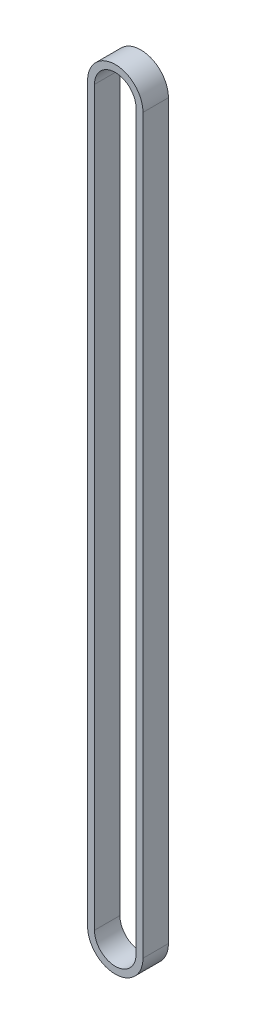
ISO-10303-21;
HEADER;
FILE_DESCRIPTION(('STEP AP214'),'2;1');
FILE_NAME('part.step','',(''),(''),'','','');
FILE_SCHEMA(('AUTOMOTIVE_DESIGN { 1 0 10303 214 1 1 1 1 }'));
ENDSEC;
DATA;
#1=APPLICATION_CONTEXT('core data for automotive mechanical design processes');
#2=APPLICATION_PROTOCOL_DEFINITION('international standard','automotive_design',2000,#1);
#3=PRODUCT_CONTEXT('',#1,'mechanical');
#4=PRODUCT('Part','Part','',(#3));
#5=PRODUCT_RELATED_PRODUCT_CATEGORY('part','',(#4));
#6=PRODUCT_DEFINITION_FORMATION('','',#4);
#7=PRODUCT_DEFINITION_CONTEXT('part definition',#1,'design');
#8=PRODUCT_DEFINITION('design','',#6,#7);
#9=PRODUCT_DEFINITION_SHAPE('','',#8);
#10=(LENGTH_UNIT() NAMED_UNIT(*) SI_UNIT(.MILLI.,.METRE.));
#11=(NAMED_UNIT(*) PLANE_ANGLE_UNIT() SI_UNIT($,.RADIAN.));
#12=(NAMED_UNIT(*) SI_UNIT($,.STERADIAN.) SOLID_ANGLE_UNIT());
#13=UNCERTAINTY_MEASURE_WITH_UNIT(LENGTH_MEASURE(1.E-05),#10,'distance_accuracy_value','');
#14=(GEOMETRIC_REPRESENTATION_CONTEXT(3) GLOBAL_UNCERTAINTY_ASSIGNED_CONTEXT((#13)) GLOBAL_UNIT_ASSIGNED_CONTEXT((#10,
#11,#12)) REPRESENTATION_CONTEXT('',''));
#15=CARTESIAN_POINT('',(0.,0.,0.));
#16=DIRECTION('',(0.,0.,1.));
#17=DIRECTION('',(1.,0.,0.));
#18=AXIS2_PLACEMENT_3D('',#15,#16,#17);
#19=CARTESIAN_POINT('',(0.,213.,7.4));
#20=DIRECTION('',(0.,0.,1.));
#21=DIRECTION('',(1.,0.,0.));
#22=AXIS2_PLACEMENT_3D('',#19,#20,#21);
#23=PLANE('',#22);
#24=CARTESIAN_POINT('',(0.,213.,7.4));
#25=DIRECTION('',(0.,0.,1.));
#26=DIRECTION('',(1.,0.,0.));
#27=AXIS2_PLACEMENT_3D('',#24,#25,#26);
#28=CIRCLE('',#27,8.05000000000004);
#29=CARTESIAN_POINT('',(8.05000000000004,213.,7.4));
#30=VERTEX_POINT('',#29);
#31=CARTESIAN_POINT('',(-8.05000000000004,213.,7.4));
#32=VERTEX_POINT('',#31);
#33=EDGE_CURVE('E138',#30,#32,#28,.T.);
#34=ORIENTED_EDGE('',*,*,#33,.T.);
#35=DIRECTION('',(0.,-1.,0.));
#36=VECTOR('',#35,1.);
#37=CARTESIAN_POINT('',(-8.05000000000004,213.,7.4));
#38=LINE('',#37,#36);
#39=CARTESIAN_POINT('',(-8.05000000000002,0.,7.4));
#40=VERTEX_POINT('',#39);
#41=EDGE_CURVE('E141',#32,#40,#38,.T.);
#42=ORIENTED_EDGE('',*,*,#41,.T.);
#43=CARTESIAN_POINT('',(0.,0.,7.4));
#44=DIRECTION('',(0.,0.,1.));
#45=DIRECTION('',(1.,0.,0.));
#46=AXIS2_PLACEMENT_3D('',#43,#44,#45);
#47=CIRCLE('',#46,8.05000000000002);
#48=CARTESIAN_POINT('',(8.05000000000002,0.,7.4));
#49=VERTEX_POINT('',#48);
#50=EDGE_CURVE('E144',#40,#49,#47,.T.);
#51=ORIENTED_EDGE('',*,*,#50,.T.);
#52=DIRECTION('',(0.,1.,0.));
#53=VECTOR('',#52,1.);
#54=CARTESIAN_POINT('',(8.05000000000004,213.,7.4));
#55=LINE('',#54,#53);
#56=EDGE_CURVE('E146',#49,#30,#55,.T.);
#57=ORIENTED_EDGE('',*,*,#56,.T.);
#58=EDGE_LOOP('',(#34,#42,#51,#57));
#59=FACE_BOUND('',#58,.T.);
#60=DIRECTION('',(0.,1.,0.));
#61=VECTOR('',#60,1.);
#62=CARTESIAN_POINT('',(6.05000000000015,0.,7.4));
#63=LINE('',#62,#61);
#64=CARTESIAN_POINT('',(6.05000000000015,0.,7.4));
#65=VERTEX_POINT('',#64);
#66=CARTESIAN_POINT('',(6.05,213.,7.4));
#67=VERTEX_POINT('',#66);
#68=EDGE_CURVE('E110',#65,#67,#63,.T.);
#69=ORIENTED_EDGE('',*,*,#68,.F.);
#70=CARTESIAN_POINT('',(0.,0.,7.4));
#71=DIRECTION('',(0.,0.,1.));
#72=DIRECTION('',(1.,0.,0.));
#73=AXIS2_PLACEMENT_3D('',#70,#71,#72);
#74=CIRCLE('',#73,6.05000000000008);
#75=CARTESIAN_POINT('',(-6.05,0.,7.4));
#76=VERTEX_POINT('',#75);
#77=EDGE_CURVE('E102',#76,#65,#74,.T.);
#78=ORIENTED_EDGE('',*,*,#77,.F.);
#79=DIRECTION('',(0.,-1.,0.));
#80=VECTOR('',#79,1.);
#81=CARTESIAN_POINT('',(-6.05,0.,7.4));
#82=LINE('',#81,#80);
#83=CARTESIAN_POINT('',(-6.05000000000004,213.,7.4));
#84=VERTEX_POINT('',#83);
#85=EDGE_CURVE('E124',#84,#76,#82,.T.);
#86=ORIENTED_EDGE('',*,*,#85,.F.);
#87=CARTESIAN_POINT('',(0.,213.,7.4));
#88=DIRECTION('',(0.,0.,1.));
#89=DIRECTION('',(1.,0.,0.));
#90=AXIS2_PLACEMENT_3D('',#87,#88,#89);
#91=CIRCLE('',#90,6.05);
#92=EDGE_CURVE('E122',#67,#84,#91,.T.);
#93=ORIENTED_EDGE('',*,*,#92,.F.);
#94=EDGE_LOOP('',(#69,#78,#86,#93));
#95=FACE_BOUND('',#94,.T.);
#96=ADVANCED_FACE('F37',(#59,#95),#23,.T.);
#97=CARTESIAN_POINT('',(0.,213.,0.));
#98=DIRECTION('',(0.,0.,1.));
#99=DIRECTION('',(1.,0.,0.));
#100=AXIS2_PLACEMENT_3D('',#97,#98,#99);
#101=PLANE('',#100);
#102=CARTESIAN_POINT('',(0.,213.,0.));
#103=DIRECTION('',(0.,0.,1.));
#104=DIRECTION('',(1.,0.,0.));
#105=AXIS2_PLACEMENT_3D('',#102,#103,#104);
#106=CIRCLE('',#105,8.05000000000004);
#107=CARTESIAN_POINT('',(8.05000000000004,213.,0.));
#108=VERTEX_POINT('',#107);
#109=CARTESIAN_POINT('',(-8.05000000000004,213.,0.));
#110=VERTEX_POINT('',#109);
#111=EDGE_CURVE('E118',#108,#110,#106,.T.);
#112=ORIENTED_EDGE('',*,*,#111,.F.);
#113=DIRECTION('',(0.,1.,0.));
#114=VECTOR('',#113,1.);
#115=CARTESIAN_POINT('',(8.05000000000004,213.,0.));
#116=LINE('',#115,#114);
#117=CARTESIAN_POINT('',(8.05000000000002,0.,0.));
#118=VERTEX_POINT('',#117);
#119=EDGE_CURVE('E142',#118,#108,#116,.T.);
#120=ORIENTED_EDGE('',*,*,#119,.F.);
#121=CARTESIAN_POINT('',(0.,0.,0.));
#122=DIRECTION('',(0.,0.,1.));
#123=DIRECTION('',(1.,0.,0.));
#124=AXIS2_PLACEMENT_3D('',#121,#122,#123);
#125=CIRCLE('',#124,8.05000000000002);
#126=CARTESIAN_POINT('',(-8.05000000000002,0.,0.));
#127=VERTEX_POINT('',#126);
#128=EDGE_CURVE('E153',#127,#118,#125,.T.);
#129=ORIENTED_EDGE('',*,*,#128,.F.);
#130=DIRECTION('',(0.,-1.,0.));
#131=VECTOR('',#130,1.);
#132=CARTESIAN_POINT('',(-8.05000000000004,213.,0.));
#133=LINE('',#132,#131);
#134=EDGE_CURVE('E151',#110,#127,#133,.T.);
#135=ORIENTED_EDGE('',*,*,#134,.F.);
#136=EDGE_LOOP('',(#112,#120,#129,#135));
#137=FACE_BOUND('',#136,.T.);
#138=CARTESIAN_POINT('',(0.,0.,0.));
#139=DIRECTION('',(0.,0.,1.));
#140=DIRECTION('',(1.,0.,0.));
#141=AXIS2_PLACEMENT_3D('',#138,#139,#140);
#142=CIRCLE('',#141,6.05000000000008);
#143=CARTESIAN_POINT('',(-6.05,0.,0.));
#144=VERTEX_POINT('',#143);
#145=CARTESIAN_POINT('',(6.05000000000015,0.,0.));
#146=VERTEX_POINT('',#145);
#147=EDGE_CURVE('E60',#144,#146,#142,.T.);
#148=ORIENTED_EDGE('',*,*,#147,.T.);
#149=DIRECTION('',(0.,1.,0.));
#150=VECTOR('',#149,1.);
#151=CARTESIAN_POINT('',(6.05000000000015,0.,0.));
#152=LINE('',#151,#150);
#153=CARTESIAN_POINT('',(6.05,213.,0.));
#154=VERTEX_POINT('',#153);
#155=EDGE_CURVE('E117',#146,#154,#152,.T.);
#156=ORIENTED_EDGE('',*,*,#155,.T.);
#157=CARTESIAN_POINT('',(0.,213.,0.));
#158=DIRECTION('',(0.,0.,1.));
#159=DIRECTION('',(1.,0.,0.));
#160=AXIS2_PLACEMENT_3D('',#157,#158,#159);
#161=CIRCLE('',#160,6.05);
#162=CARTESIAN_POINT('',(-6.05000000000004,213.,0.));
#163=VERTEX_POINT('',#162);
#164=EDGE_CURVE('E130',#154,#163,#161,.T.);
#165=ORIENTED_EDGE('',*,*,#164,.T.);
#166=DIRECTION('',(0.,-1.,0.));
#167=VECTOR('',#166,1.);
#168=CARTESIAN_POINT('',(-6.05,0.,0.));
#169=LINE('',#168,#167);
#170=EDGE_CURVE('E111',#163,#144,#169,.T.);
#171=ORIENTED_EDGE('',*,*,#170,.T.);
#172=EDGE_LOOP('',(#148,#156,#165,#171));
#173=FACE_BOUND('',#172,.T.);
#174=ADVANCED_FACE('F171',(#137,#173),#101,.F.);
#175=CARTESIAN_POINT('',(0.,213.,7.4));
#176=DIRECTION('',(0.,0.,-1.));
#177=DIRECTION('',(-1.,0.,0.));
#178=AXIS2_PLACEMENT_3D('',#175,#176,#177);
#179=CYLINDRICAL_SURFACE('',#178,8.05000000000004);
#180=ORIENTED_EDGE('',*,*,#111,.T.);
#181=DIRECTION('',(0.,0.,-1.));
#182=VECTOR('',#181,1.);
#183=CARTESIAN_POINT('',(-8.05000000000004,213.,7.4));
#184=LINE('',#183,#182);
#185=EDGE_CURVE('E11',#32,#110,#184,.T.);
#186=ORIENTED_EDGE('',*,*,#185,.F.);
#187=ORIENTED_EDGE('',*,*,#33,.F.);
#188=DIRECTION('',(0.,0.,-1.));
#189=VECTOR('',#188,1.);
#190=CARTESIAN_POINT('',(8.05000000000004,213.,7.4));
#191=LINE('',#190,#189);
#192=EDGE_CURVE('E148',#30,#108,#191,.T.);
#193=ORIENTED_EDGE('',*,*,#192,.T.);
#194=EDGE_LOOP('',(#180,#186,#187,#193));
#195=FACE_BOUND('',#194,.T.);
#196=ADVANCED_FACE('F39',(#195),#179,.T.);
#197=CARTESIAN_POINT('',(-8.05000000000004,213.,7.4));
#198=DIRECTION('',(1.,0.,0.));
#199=DIRECTION('',(0.,1.,0.));
#200=AXIS2_PLACEMENT_3D('',#197,#198,#199);
#201=PLANE('',#200);
#202=ORIENTED_EDGE('',*,*,#134,.T.);
#203=DIRECTION('',(0.,0.,-1.));
#204=VECTOR('',#203,1.);
#205=CARTESIAN_POINT('',(-8.05000000000002,0.,7.4));
#206=LINE('',#205,#204);
#207=EDGE_CURVE('E45',#40,#127,#206,.T.);
#208=ORIENTED_EDGE('',*,*,#207,.F.);
#209=ORIENTED_EDGE('',*,*,#41,.F.);
#210=ORIENTED_EDGE('',*,*,#185,.T.);
#211=EDGE_LOOP('',(#202,#208,#209,#210));
#212=FACE_BOUND('',#211,.T.);
#213=ADVANCED_FACE('F181',(#212),#201,.F.);
#214=CARTESIAN_POINT('',(0.,0.,7.4));
#215=DIRECTION('',(0.,0.,-1.));
#216=DIRECTION('',(-1.,0.,0.));
#217=AXIS2_PLACEMENT_3D('',#214,#215,#216);
#218=CYLINDRICAL_SURFACE('',#217,8.05000000000002);
#219=ORIENTED_EDGE('',*,*,#128,.T.);
#220=DIRECTION('',(0.,0.,-1.));
#221=VECTOR('',#220,1.);
#222=CARTESIAN_POINT('',(8.05000000000002,0.,7.4));
#223=LINE('',#222,#221);
#224=EDGE_CURVE('E158',#49,#118,#223,.T.);
#225=ORIENTED_EDGE('',*,*,#224,.F.);
#226=ORIENTED_EDGE('',*,*,#50,.F.);
#227=ORIENTED_EDGE('',*,*,#207,.T.);
#228=EDGE_LOOP('',(#219,#225,#226,#227));
#229=FACE_BOUND('',#228,.T.);
#230=ADVANCED_FACE('F165',(#229),#218,.T.);
#231=CARTESIAN_POINT('',(8.05000000000004,213.,7.4));
#232=DIRECTION('',(-1.,0.,0.));
#233=DIRECTION('',(0.,-1.,0.));
#234=AXIS2_PLACEMENT_3D('',#231,#232,#233);
#235=PLANE('',#234);
#236=ORIENTED_EDGE('',*,*,#119,.T.);
#237=ORIENTED_EDGE('',*,*,#192,.F.);
#238=ORIENTED_EDGE('',*,*,#56,.F.);
#239=ORIENTED_EDGE('',*,*,#224,.T.);
#240=EDGE_LOOP('',(#236,#237,#238,#239));
#241=FACE_BOUND('',#240,.T.);
#242=ADVANCED_FACE('F175',(#241),#235,.F.);
#243=CARTESIAN_POINT('',(0.,0.,7.4));
#244=DIRECTION('',(0.,0.,-1.));
#245=DIRECTION('',(-1.,0.,0.));
#246=AXIS2_PLACEMENT_3D('',#243,#244,#245);
#247=CYLINDRICAL_SURFACE('',#246,6.05000000000008);
#248=ORIENTED_EDGE('',*,*,#147,.F.);
#249=DIRECTION('',(0.,0.,-1.));
#250=VECTOR('',#249,1.);
#251=CARTESIAN_POINT('',(-6.05,0.,7.4));
#252=LINE('',#251,#250);
#253=EDGE_CURVE('E106',#76,#144,#252,.T.);
#254=ORIENTED_EDGE('',*,*,#253,.F.);
#255=ORIENTED_EDGE('',*,*,#77,.T.);
#256=DIRECTION('',(0.,0.,-1.));
#257=VECTOR('',#256,1.);
#258=CARTESIAN_POINT('',(6.05000000000015,0.,7.4));
#259=LINE('',#258,#257);
#260=EDGE_CURVE('E105',#65,#146,#259,.T.);
#261=ORIENTED_EDGE('',*,*,#260,.T.);
#262=EDGE_LOOP('',(#248,#254,#255,#261));
#263=FACE_BOUND('',#262,.T.);
#264=ADVANCED_FACE('F104',(#263),#247,.F.);
#265=CARTESIAN_POINT('',(6.05000000000015,0.,7.4));
#266=DIRECTION('',(-1.,0.,0.));
#267=DIRECTION('',(0.,-1.,0.));
#268=AXIS2_PLACEMENT_3D('',#265,#266,#267);
#269=PLANE('',#268);
#270=ORIENTED_EDGE('',*,*,#155,.F.);
#271=ORIENTED_EDGE('',*,*,#260,.F.);
#272=ORIENTED_EDGE('',*,*,#68,.T.);
#273=DIRECTION('',(0.,0.,-1.));
#274=VECTOR('',#273,1.);
#275=CARTESIAN_POINT('',(6.05,213.,7.4));
#276=LINE('',#275,#274);
#277=EDGE_CURVE('E119',#67,#154,#276,.T.);
#278=ORIENTED_EDGE('',*,*,#277,.T.);
#279=EDGE_LOOP('',(#270,#271,#272,#278));
#280=FACE_BOUND('',#279,.T.);
#281=ADVANCED_FACE('F114',(#280),#269,.T.);
#282=CARTESIAN_POINT('',(0.,213.,7.4));
#283=DIRECTION('',(0.,0.,-1.));
#284=DIRECTION('',(-1.,0.,0.));
#285=AXIS2_PLACEMENT_3D('',#282,#283,#284);
#286=CYLINDRICAL_SURFACE('',#285,6.05);
#287=ORIENTED_EDGE('',*,*,#164,.F.);
#288=ORIENTED_EDGE('',*,*,#277,.F.);
#289=ORIENTED_EDGE('',*,*,#92,.T.);
#290=DIRECTION('',(0.,0.,-1.));
#291=VECTOR('',#290,1.);
#292=CARTESIAN_POINT('',(-6.05000000000004,213.,7.4));
#293=LINE('',#292,#291);
#294=EDGE_CURVE('E52',#84,#163,#293,.T.);
#295=ORIENTED_EDGE('',*,*,#294,.T.);
#296=EDGE_LOOP('',(#287,#288,#289,#295));
#297=FACE_BOUND('',#296,.T.);
#298=ADVANCED_FACE('F204',(#297),#286,.F.);
#299=CARTESIAN_POINT('',(-6.05,0.,7.4));
#300=DIRECTION('',(1.,0.,0.));
#301=DIRECTION('',(0.,1.,0.));
#302=AXIS2_PLACEMENT_3D('',#299,#300,#301);
#303=PLANE('',#302);
#304=ORIENTED_EDGE('',*,*,#170,.F.);
#305=ORIENTED_EDGE('',*,*,#294,.F.);
#306=ORIENTED_EDGE('',*,*,#85,.T.);
#307=ORIENTED_EDGE('',*,*,#253,.T.);
#308=EDGE_LOOP('',(#304,#305,#306,#307));
#309=FACE_BOUND('',#308,.T.);
#310=ADVANCED_FACE('F208',(#309),#303,.T.);
#311=CLOSED_SHELL('',(#96,#174,#196,#213,#230,#242,#264,#281,#298,#310));
#312=MANIFOLD_SOLID_BREP('B2',#311);
#313=ADVANCED_BREP_SHAPE_REPRESENTATION('',(#18,#312),#14);
#314=SHAPE_DEFINITION_REPRESENTATION(#9,#313);
ENDSEC;
END-ISO-10303-21;
